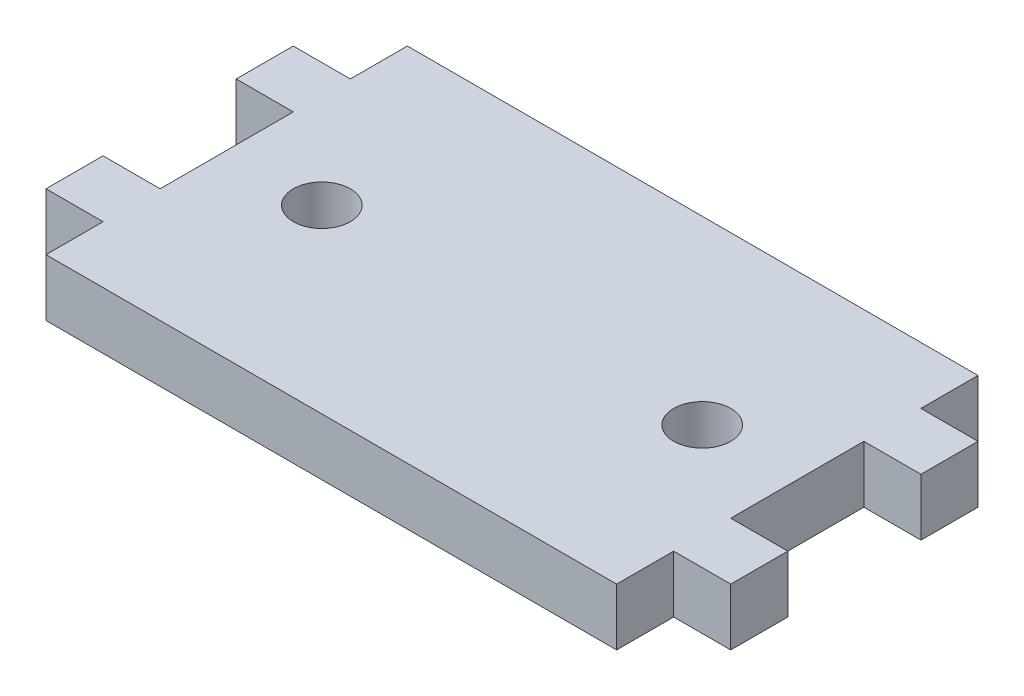
ISO-10303-21;
HEADER;
FILE_DESCRIPTION(('STEP AP214'),'2;1');
FILE_NAME('part.step','',(''),(''),'','','');
FILE_SCHEMA(('AUTOMOTIVE_DESIGN { 1 0 10303 214 1 1 1 1 }'));
ENDSEC;
DATA;
#1=APPLICATION_CONTEXT('core data for automotive mechanical design processes');
#2=APPLICATION_PROTOCOL_DEFINITION('international standard','automotive_design',2000,#1);
#3=PRODUCT_CONTEXT('',#1,'mechanical');
#4=PRODUCT('Part','Part','',(#3));
#5=PRODUCT_RELATED_PRODUCT_CATEGORY('part','',(#4));
#6=PRODUCT_DEFINITION_FORMATION('','',#4);
#7=PRODUCT_DEFINITION_CONTEXT('part definition',#1,'design');
#8=PRODUCT_DEFINITION('design','',#6,#7);
#9=PRODUCT_DEFINITION_SHAPE('','',#8);
#10=(LENGTH_UNIT() NAMED_UNIT(*) SI_UNIT(.MILLI.,.METRE.));
#11=(NAMED_UNIT(*) PLANE_ANGLE_UNIT() SI_UNIT($,.RADIAN.));
#12=(NAMED_UNIT(*) SI_UNIT($,.STERADIAN.) SOLID_ANGLE_UNIT());
#13=UNCERTAINTY_MEASURE_WITH_UNIT(LENGTH_MEASURE(1.E-05),#10,'distance_accuracy_value','');
#14=(GEOMETRIC_REPRESENTATION_CONTEXT(3) GLOBAL_UNCERTAINTY_ASSIGNED_CONTEXT((#13)) GLOBAL_UNIT_ASSIGNED_CONTEXT((#10,
#11,#12)) REPRESENTATION_CONTEXT('',''));
#15=CARTESIAN_POINT('',(0.,0.,0.));
#16=DIRECTION('',(0.,0.,1.));
#17=DIRECTION('',(1.,0.,0.));
#18=AXIS2_PLACEMENT_3D('',#15,#16,#17);
#19=CARTESIAN_POINT('',(0.,3.,0.));
#20=DIRECTION('',(0.,-1.,0.));
#21=DIRECTION('',(0.,0.,-1.));
#22=AXIS2_PLACEMENT_3D('',#19,#20,#21);
#23=PLANE('',#22);
#24=CARTESIAN_POINT('',(-34.8674121918661,3.,-3.5));
#25=DIRECTION('',(0.,1.,0.));
#26=DIRECTION('',(0.,0.,1.));
#27=AXIS2_PLACEMENT_3D('',#24,#25,#26);
#28=CIRCLE('',#27,1.5);
#29=CARTESIAN_POINT('',(-34.8674121918661,3.,-2.));
#30=VERTEX_POINT('',#29);
#31=EDGE_CURVE('E204',#30,#30,#28,.T.);
#32=ORIENTED_EDGE('',*,*,#31,.F.);
#33=EDGE_LOOP('',(#32));
#34=FACE_BOUND('',#33,.T.);
#35=DIRECTION('',(1.,0.,0.));
#36=VECTOR('',#35,1.);
#37=CARTESIAN_POINT('',(-39.8674121918661,3.,-7.));
#38=LINE('',#37,#36);
#39=CARTESIAN_POINT('',(-42.8674121918661,3.,-7.));
#40=VERTEX_POINT('',#39);
#41=CARTESIAN_POINT('',(-39.8674121918661,3.,-7.));
#42=VERTEX_POINT('',#41);
#43=EDGE_CURVE('E239',#40,#42,#38,.T.);
#44=ORIENTED_EDGE('',*,*,#43,.T.);
#45=DIRECTION('',(0.,0.,1.));
#46=VECTOR('',#45,1.);
#47=CARTESIAN_POINT('',(-39.8674121918661,3.,0.));
#48=LINE('',#47,#46);
#49=CARTESIAN_POINT('',(-39.8674121918661,3.,0.));
#50=VERTEX_POINT('',#49);
#51=EDGE_CURVE('E127',#42,#50,#48,.T.);
#52=ORIENTED_EDGE('',*,*,#51,.T.);
#53=DIRECTION('',(-1.,0.,0.));
#54=VECTOR('',#53,1.);
#55=CARTESIAN_POINT('',(-42.8674121918661,3.,0.));
#56=LINE('',#55,#54);
#57=CARTESIAN_POINT('',(-42.8674121918661,3.,0.));
#58=VERTEX_POINT('',#57);
#59=EDGE_CURVE('E290',#50,#58,#56,.T.);
#60=ORIENTED_EDGE('',*,*,#59,.T.);
#61=DIRECTION('',(0.,0.,1.));
#62=VECTOR('',#61,1.);
#63=CARTESIAN_POINT('',(-42.8674121918661,3.,3.));
#64=LINE('',#63,#62);
#65=CARTESIAN_POINT('',(-42.8674121918661,3.,3.));
#66=VERTEX_POINT('',#65);
#67=EDGE_CURVE('E309',#58,#66,#64,.T.);
#68=ORIENTED_EDGE('',*,*,#67,.T.);
#69=DIRECTION('',(1.,0.,0.));
#70=VECTOR('',#69,1.);
#71=CARTESIAN_POINT('',(-39.8674121918661,3.,3.));
#72=LINE('',#71,#70);
#73=CARTESIAN_POINT('',(-39.8674121918661,3.,3.));
#74=VERTEX_POINT('',#73);
#75=EDGE_CURVE('E306',#66,#74,#72,.T.);
#76=ORIENTED_EDGE('',*,*,#75,.T.);
#77=DIRECTION('',(0.,0.,1.));
#78=VECTOR('',#77,1.);
#79=CARTESIAN_POINT('',(-39.8674121918661,3.,5.99999999999999));
#80=LINE('',#79,#78);
#81=CARTESIAN_POINT('',(-39.8674121918661,3.,5.99999999999999));
#82=VERTEX_POINT('',#81);
#83=EDGE_CURVE('E308',#74,#82,#80,.T.);
#84=ORIENTED_EDGE('',*,*,#83,.T.);
#85=DIRECTION('',(1.,0.,0.));
#86=VECTOR('',#85,1.);
#87=CARTESIAN_POINT('',(-9.86741219186607,3.,5.99999999999999));
#88=LINE('',#87,#86);
#89=CARTESIAN_POINT('',(-9.86741219186607,3.,5.99999999999999));
#90=VERTEX_POINT('',#89);
#91=EDGE_CURVE('E311',#82,#90,#88,.T.);
#92=ORIENTED_EDGE('',*,*,#91,.T.);
#93=DIRECTION('',(0.,0.,-1.));
#94=VECTOR('',#93,1.);
#95=CARTESIAN_POINT('',(-9.86741219186607,3.,3.));
#96=LINE('',#95,#94);
#97=CARTESIAN_POINT('',(-9.86741219186607,3.,3.));
#98=VERTEX_POINT('',#97);
#99=EDGE_CURVE('E317',#90,#98,#96,.T.);
#100=ORIENTED_EDGE('',*,*,#99,.T.);
#101=DIRECTION('',(1.,0.,0.));
#102=VECTOR('',#101,1.);
#103=CARTESIAN_POINT('',(-6.86741219186606,3.,3.));
#104=LINE('',#103,#102);
#105=CARTESIAN_POINT('',(-6.86741219186606,3.,3.));
#106=VERTEX_POINT('',#105);
#107=EDGE_CURVE('E319',#98,#106,#104,.T.);
#108=ORIENTED_EDGE('',*,*,#107,.T.);
#109=DIRECTION('',(0.,0.,-1.));
#110=VECTOR('',#109,1.);
#111=CARTESIAN_POINT('',(-6.86741219186606,3.,0.));
#112=LINE('',#111,#110);
#113=CARTESIAN_POINT('',(-6.86741219186606,3.,0.));
#114=VERTEX_POINT('',#113);
#115=EDGE_CURVE('E321',#106,#114,#112,.T.);
#116=ORIENTED_EDGE('',*,*,#115,.T.);
#117=DIRECTION('',(-1.,0.,0.));
#118=VECTOR('',#117,1.);
#119=CARTESIAN_POINT('',(-9.86741219186607,3.,0.));
#120=LINE('',#119,#118);
#121=CARTESIAN_POINT('',(-9.86741219186607,3.,0.));
#122=VERTEX_POINT('',#121);
#123=EDGE_CURVE('E323',#114,#122,#120,.T.);
#124=ORIENTED_EDGE('',*,*,#123,.T.);
#125=DIRECTION('',(0.,0.,-1.));
#126=VECTOR('',#125,1.);
#127=CARTESIAN_POINT('',(-9.86741219186607,3.,-7.));
#128=LINE('',#127,#126);
#129=CARTESIAN_POINT('',(-9.86741219186607,3.,-7.));
#130=VERTEX_POINT('',#129);
#131=EDGE_CURVE('E325',#122,#130,#128,.T.);
#132=ORIENTED_EDGE('',*,*,#131,.T.);
#133=DIRECTION('',(1.,0.,0.));
#134=VECTOR('',#133,1.);
#135=CARTESIAN_POINT('',(-6.86741219186607,3.,-7.));
#136=LINE('',#135,#134);
#137=CARTESIAN_POINT('',(-6.86741219186607,3.,-7.));
#138=VERTEX_POINT('',#137);
#139=EDGE_CURVE('E327',#130,#138,#136,.T.);
#140=ORIENTED_EDGE('',*,*,#139,.T.);
#141=DIRECTION('',(0.,0.,-1.));
#142=VECTOR('',#141,1.);
#143=CARTESIAN_POINT('',(-6.86741219186607,3.,-9.99999999999999));
#144=LINE('',#143,#142);
#145=CARTESIAN_POINT('',(-6.86741219186607,3.,-9.99999999999999));
#146=VERTEX_POINT('',#145);
#147=EDGE_CURVE('E329',#138,#146,#144,.T.);
#148=ORIENTED_EDGE('',*,*,#147,.T.);
#149=DIRECTION('',(-1.,0.,0.));
#150=VECTOR('',#149,1.);
#151=CARTESIAN_POINT('',(-9.86741219186607,3.,-9.99999999999999));
#152=LINE('',#151,#150);
#153=CARTESIAN_POINT('',(-9.86741219186607,3.,-9.99999999999999));
#154=VERTEX_POINT('',#153);
#155=EDGE_CURVE('E331',#146,#154,#152,.T.);
#156=ORIENTED_EDGE('',*,*,#155,.T.);
#157=DIRECTION('',(0.,0.,-1.));
#158=VECTOR('',#157,1.);
#159=CARTESIAN_POINT('',(-9.86741219186607,3.,-13.));
#160=LINE('',#159,#158);
#161=CARTESIAN_POINT('',(-9.86741219186607,3.,-13.));
#162=VERTEX_POINT('',#161);
#163=EDGE_CURVE('E333',#154,#162,#160,.T.);
#164=ORIENTED_EDGE('',*,*,#163,.T.);
#165=DIRECTION('',(-1.,0.,0.));
#166=VECTOR('',#165,1.);
#167=CARTESIAN_POINT('',(-39.8674121918661,3.,-13.));
#168=LINE('',#167,#166);
#169=CARTESIAN_POINT('',(-39.8674121918661,3.,-13.));
#170=VERTEX_POINT('',#169);
#171=EDGE_CURVE('E182',#162,#170,#168,.T.);
#172=ORIENTED_EDGE('',*,*,#171,.T.);
#173=DIRECTION('',(0.,0.,1.));
#174=VECTOR('',#173,1.);
#175=CARTESIAN_POINT('',(-39.8674121918661,3.,-9.99999999999999));
#176=LINE('',#175,#174);
#177=CARTESIAN_POINT('',(-39.8674121918661,3.,-9.99999999999999));
#178=VERTEX_POINT('',#177);
#179=EDGE_CURVE('E176',#170,#178,#176,.T.);
#180=ORIENTED_EDGE('',*,*,#179,.T.);
#181=DIRECTION('',(-1.,0.,0.));
#182=VECTOR('',#181,1.);
#183=CARTESIAN_POINT('',(-42.8674121918661,3.,-9.99999999999999));
#184=LINE('',#183,#182);
#185=CARTESIAN_POINT('',(-42.8674121918661,3.,-9.99999999999999));
#186=VERTEX_POINT('',#185);
#187=EDGE_CURVE('E180',#178,#186,#184,.T.);
#188=ORIENTED_EDGE('',*,*,#187,.T.);
#189=DIRECTION('',(0.,0.,1.));
#190=VECTOR('',#189,1.);
#191=CARTESIAN_POINT('',(-42.8674121918661,3.,-7.));
#192=LINE('',#191,#190);
#193=EDGE_CURVE('E48',#186,#40,#192,.T.);
#194=ORIENTED_EDGE('',*,*,#193,.T.);
#195=EDGE_LOOP('',(#44,#52,#60,#68,#76,#84,#92,#100,#108,#116,#124,#132,#140,#148,#156,#164,
#172,#180,#188,#194));
#196=FACE_BOUND('',#195,.T.);
#197=CARTESIAN_POINT('',(-14.8674121918661,3.,-3.50000000000001));
#198=DIRECTION('',(0.,1.,0.));
#199=DIRECTION('',(0.,0.,-1.));
#200=AXIS2_PLACEMENT_3D('',#197,#198,#199);
#201=CIRCLE('',#200,1.5);
#202=CARTESIAN_POINT('',(-14.8674121918661,3.,-5.00000000000001));
#203=VERTEX_POINT('',#202);
#204=EDGE_CURVE('E376',#203,#203,#201,.T.);
#205=ORIENTED_EDGE('',*,*,#204,.F.);
#206=EDGE_LOOP('',(#205));
#207=FACE_BOUND('',#206,.T.);
#208=ADVANCED_FACE('F31',(#34,#196,#207),#23,.F.);
#209=CARTESIAN_POINT('',(0.,0.,0.));
#210=DIRECTION('',(0.,-1.,0.));
#211=DIRECTION('',(0.,0.,-1.));
#212=AXIS2_PLACEMENT_3D('',#209,#210,#211);
#213=PLANE('',#212);
#214=CARTESIAN_POINT('',(-34.8674121918661,0.,-3.5));
#215=DIRECTION('',(0.,1.,0.));
#216=DIRECTION('',(0.,0.,1.));
#217=AXIS2_PLACEMENT_3D('',#214,#215,#216);
#218=CIRCLE('',#217,1.5);
#219=CARTESIAN_POINT('',(-34.8674121918661,0.,-2.));
#220=VERTEX_POINT('',#219);
#221=EDGE_CURVE('E381',#220,#220,#218,.T.);
#222=ORIENTED_EDGE('',*,*,#221,.T.);
#223=EDGE_LOOP('',(#222));
#224=FACE_BOUND('',#223,.T.);
#225=DIRECTION('',(1.,0.,0.));
#226=VECTOR('',#225,1.);
#227=CARTESIAN_POINT('',(-39.8674121918661,0.,-7.));
#228=LINE('',#227,#226);
#229=CARTESIAN_POINT('',(-42.8674121918661,0.,-7.));
#230=VERTEX_POINT('',#229);
#231=CARTESIAN_POINT('',(-39.8674121918661,0.,-7.));
#232=VERTEX_POINT('',#231);
#233=EDGE_CURVE('E200',#230,#232,#228,.T.);
#234=ORIENTED_EDGE('',*,*,#233,.F.);
#235=DIRECTION('',(0.,0.,1.));
#236=VECTOR('',#235,1.);
#237=CARTESIAN_POINT('',(-42.8674121918661,0.,-7.));
#238=LINE('',#237,#236);
#239=CARTESIAN_POINT('',(-42.8674121918661,0.,-9.99999999999999));
#240=VERTEX_POINT('',#239);
#241=EDGE_CURVE('E119',#240,#230,#238,.T.);
#242=ORIENTED_EDGE('',*,*,#241,.F.);
#243=DIRECTION('',(-1.,0.,0.));
#244=VECTOR('',#243,1.);
#245=CARTESIAN_POINT('',(-42.8674121918661,0.,-9.99999999999999));
#246=LINE('',#245,#244);
#247=CARTESIAN_POINT('',(-39.8674121918661,0.,-9.99999999999999));
#248=VERTEX_POINT('',#247);
#249=EDGE_CURVE('E113',#248,#240,#246,.T.);
#250=ORIENTED_EDGE('',*,*,#249,.F.);
#251=DIRECTION('',(0.,0.,1.));
#252=VECTOR('',#251,1.);
#253=CARTESIAN_POINT('',(-39.8674121918661,0.,-9.99999999999999));
#254=LINE('',#253,#252);
#255=CARTESIAN_POINT('',(-39.8674121918661,0.,-13.));
#256=VERTEX_POINT('',#255);
#257=EDGE_CURVE('E190',#256,#248,#254,.T.);
#258=ORIENTED_EDGE('',*,*,#257,.F.);
#259=DIRECTION('',(-1.,0.,0.));
#260=VECTOR('',#259,1.);
#261=CARTESIAN_POINT('',(-39.8674121918661,0.,-13.));
#262=LINE('',#261,#260);
#263=CARTESIAN_POINT('',(-9.86741219186607,0.,-13.));
#264=VERTEX_POINT('',#263);
#265=EDGE_CURVE('E234',#264,#256,#262,.T.);
#266=ORIENTED_EDGE('',*,*,#265,.F.);
#267=DIRECTION('',(0.,0.,-1.));
#268=VECTOR('',#267,1.);
#269=CARTESIAN_POINT('',(-9.86741219186607,0.,-13.));
#270=LINE('',#269,#268);
#271=CARTESIAN_POINT('',(-9.86741219186607,0.,-9.99999999999999));
#272=VERTEX_POINT('',#271);
#273=EDGE_CURVE('E232',#272,#264,#270,.T.);
#274=ORIENTED_EDGE('',*,*,#273,.F.);
#275=DIRECTION('',(-1.,0.,0.));
#276=VECTOR('',#275,1.);
#277=CARTESIAN_POINT('',(-9.86741219186607,0.,-9.99999999999999));
#278=LINE('',#277,#276);
#279=CARTESIAN_POINT('',(-6.86741219186607,0.,-9.99999999999999));
#280=VERTEX_POINT('',#279);
#281=EDGE_CURVE('E230',#280,#272,#278,.T.);
#282=ORIENTED_EDGE('',*,*,#281,.F.);
#283=DIRECTION('',(0.,0.,-1.));
#284=VECTOR('',#283,1.);
#285=CARTESIAN_POINT('',(-6.86741219186607,0.,-9.99999999999999));
#286=LINE('',#285,#284);
#287=CARTESIAN_POINT('',(-6.86741219186607,0.,-7.));
#288=VERTEX_POINT('',#287);
#289=EDGE_CURVE('E228',#288,#280,#286,.T.);
#290=ORIENTED_EDGE('',*,*,#289,.F.);
#291=DIRECTION('',(1.,0.,0.));
#292=VECTOR('',#291,1.);
#293=CARTESIAN_POINT('',(-6.86741219186607,0.,-7.));
#294=LINE('',#293,#292);
#295=CARTESIAN_POINT('',(-9.86741219186607,0.,-7.));
#296=VERTEX_POINT('',#295);
#297=EDGE_CURVE('E226',#296,#288,#294,.T.);
#298=ORIENTED_EDGE('',*,*,#297,.F.);
#299=DIRECTION('',(0.,0.,-1.));
#300=VECTOR('',#299,1.);
#301=CARTESIAN_POINT('',(-9.86741219186607,0.,-7.));
#302=LINE('',#301,#300);
#303=CARTESIAN_POINT('',(-9.86741219186607,0.,0.));
#304=VERTEX_POINT('',#303);
#305=EDGE_CURVE('E224',#304,#296,#302,.T.);
#306=ORIENTED_EDGE('',*,*,#305,.F.);
#307=DIRECTION('',(-1.,0.,0.));
#308=VECTOR('',#307,1.);
#309=CARTESIAN_POINT('',(-9.86741219186607,0.,0.));
#310=LINE('',#309,#308);
#311=CARTESIAN_POINT('',(-6.86741219186606,0.,0.));
#312=VERTEX_POINT('',#311);
#313=EDGE_CURVE('E222',#312,#304,#310,.T.);
#314=ORIENTED_EDGE('',*,*,#313,.F.);
#315=DIRECTION('',(0.,0.,-1.));
#316=VECTOR('',#315,1.);
#317=CARTESIAN_POINT('',(-6.86741219186606,0.,0.));
#318=LINE('',#317,#316);
#319=CARTESIAN_POINT('',(-6.86741219186606,0.,3.));
#320=VERTEX_POINT('',#319);
#321=EDGE_CURVE('E220',#320,#312,#318,.T.);
#322=ORIENTED_EDGE('',*,*,#321,.F.);
#323=DIRECTION('',(1.,0.,0.));
#324=VECTOR('',#323,1.);
#325=CARTESIAN_POINT('',(-6.86741219186606,0.,3.));
#326=LINE('',#325,#324);
#327=CARTESIAN_POINT('',(-9.86741219186607,0.,3.));
#328=VERTEX_POINT('',#327);
#329=EDGE_CURVE('E218',#328,#320,#326,.T.);
#330=ORIENTED_EDGE('',*,*,#329,.F.);
#331=DIRECTION('',(0.,0.,-1.));
#332=VECTOR('',#331,1.);
#333=CARTESIAN_POINT('',(-9.86741219186607,0.,3.));
#334=LINE('',#333,#332);
#335=CARTESIAN_POINT('',(-9.86741219186607,0.,5.99999999999999));
#336=VERTEX_POINT('',#335);
#337=EDGE_CURVE('E216',#336,#328,#334,.T.);
#338=ORIENTED_EDGE('',*,*,#337,.F.);
#339=DIRECTION('',(1.,0.,0.));
#340=VECTOR('',#339,1.);
#341=CARTESIAN_POINT('',(-9.86741219186607,0.,5.99999999999999));
#342=LINE('',#341,#340);
#343=CARTESIAN_POINT('',(-39.8674121918661,0.,5.99999999999999));
#344=VERTEX_POINT('',#343);
#345=EDGE_CURVE('E214',#344,#336,#342,.T.);
#346=ORIENTED_EDGE('',*,*,#345,.F.);
#347=DIRECTION('',(0.,0.,1.));
#348=VECTOR('',#347,1.);
#349=CARTESIAN_POINT('',(-39.8674121918661,0.,5.99999999999999));
#350=LINE('',#349,#348);
#351=CARTESIAN_POINT('',(-39.8674121918661,0.,3.));
#352=VERTEX_POINT('',#351);
#353=EDGE_CURVE('E212',#352,#344,#350,.T.);
#354=ORIENTED_EDGE('',*,*,#353,.F.);
#355=DIRECTION('',(1.,0.,0.));
#356=VECTOR('',#355,1.);
#357=CARTESIAN_POINT('',(-39.8674121918661,0.,3.));
#358=LINE('',#357,#356);
#359=CARTESIAN_POINT('',(-42.8674121918661,0.,3.));
#360=VERTEX_POINT('',#359);
#361=EDGE_CURVE('E210',#360,#352,#358,.T.);
#362=ORIENTED_EDGE('',*,*,#361,.F.);
#363=DIRECTION('',(0.,0.,1.));
#364=VECTOR('',#363,1.);
#365=CARTESIAN_POINT('',(-42.8674121918661,0.,3.));
#366=LINE('',#365,#364);
#367=CARTESIAN_POINT('',(-42.8674121918661,0.,0.));
#368=VERTEX_POINT('',#367);
#369=EDGE_CURVE('E208',#368,#360,#366,.T.);
#370=ORIENTED_EDGE('',*,*,#369,.F.);
#371=DIRECTION('',(-1.,0.,0.));
#372=VECTOR('',#371,1.);
#373=CARTESIAN_POINT('',(-42.8674121918661,0.,0.));
#374=LINE('',#373,#372);
#375=CARTESIAN_POINT('',(-39.8674121918661,0.,0.));
#376=VERTEX_POINT('',#375);
#377=EDGE_CURVE('E206',#376,#368,#374,.T.);
#378=ORIENTED_EDGE('',*,*,#377,.F.);
#379=DIRECTION('',(0.,0.,1.));
#380=VECTOR('',#379,1.);
#381=CARTESIAN_POINT('',(-39.8674121918661,0.,0.));
#382=LINE('',#381,#380);
#383=EDGE_CURVE('E203',#232,#376,#382,.T.);
#384=ORIENTED_EDGE('',*,*,#383,.F.);
#385=EDGE_LOOP('',(#234,#242,#250,#258,#266,#274,#282,#290,#298,#306,#314,#322,#330,#338,#346,
#354,#362,#370,#378,#384));
#386=FACE_BOUND('',#385,.T.);
#387=CARTESIAN_POINT('',(-14.8674121918661,0.,-3.50000000000001));
#388=DIRECTION('',(0.,1.,0.));
#389=DIRECTION('',(0.,0.,-1.));
#390=AXIS2_PLACEMENT_3D('',#387,#388,#389);
#391=CIRCLE('',#390,1.5);
#392=CARTESIAN_POINT('',(-14.8674121918661,0.,-5.00000000000001));
#393=VERTEX_POINT('',#392);
#394=EDGE_CURVE('E379',#393,#393,#391,.T.);
#395=ORIENTED_EDGE('',*,*,#394,.T.);
#396=EDGE_LOOP('',(#395));
#397=FACE_BOUND('',#396,.T.);
#398=ADVANCED_FACE('F294',(#224,#386,#397),#213,.T.);
#399=CARTESIAN_POINT('',(-39.8674121918661,3.,-7.));
#400=DIRECTION('',(0.,0.,-1.));
#401=DIRECTION('',(-1.,0.,0.));
#402=AXIS2_PLACEMENT_3D('',#399,#400,#401);
#403=PLANE('',#402);
#404=ORIENTED_EDGE('',*,*,#233,.T.);
#405=DIRECTION('',(0.,-1.,0.));
#406=VECTOR('',#405,1.);
#407=CARTESIAN_POINT('',(-39.8674121918661,3.,-7.));
#408=LINE('',#407,#406);
#409=EDGE_CURVE('E11',#42,#232,#408,.T.);
#410=ORIENTED_EDGE('',*,*,#409,.F.);
#411=ORIENTED_EDGE('',*,*,#43,.F.);
#412=DIRECTION('',(0.,-1.,0.));
#413=VECTOR('',#412,1.);
#414=CARTESIAN_POINT('',(-42.8674121918661,3.,-7.));
#415=LINE('',#414,#413);
#416=EDGE_CURVE('E196',#40,#230,#415,.T.);
#417=ORIENTED_EDGE('',*,*,#416,.T.);
#418=EDGE_LOOP('',(#404,#410,#411,#417));
#419=FACE_BOUND('',#418,.T.);
#420=ADVANCED_FACE('F33',(#419),#403,.F.);
#421=CARTESIAN_POINT('',(-39.8674121918661,3.,0.));
#422=DIRECTION('',(1.,0.,0.));
#423=DIRECTION('',(0.,0.,-1.));
#424=AXIS2_PLACEMENT_3D('',#421,#422,#423);
#425=PLANE('',#424);
#426=ORIENTED_EDGE('',*,*,#383,.T.);
#427=DIRECTION('',(0.,-1.,0.));
#428=VECTOR('',#427,1.);
#429=CARTESIAN_POINT('',(-39.8674121918661,3.,0.));
#430=LINE('',#429,#428);
#431=EDGE_CURVE('E40',#50,#376,#430,.T.);
#432=ORIENTED_EDGE('',*,*,#431,.F.);
#433=ORIENTED_EDGE('',*,*,#51,.F.);
#434=ORIENTED_EDGE('',*,*,#409,.T.);
#435=EDGE_LOOP('',(#426,#432,#433,#434));
#436=FACE_BOUND('',#435,.T.);
#437=ADVANCED_FACE('F554',(#436),#425,.F.);
#438=CARTESIAN_POINT('',(-42.8674121918661,3.,0.));
#439=DIRECTION('',(0.,0.,1.));
#440=DIRECTION('',(1.,0.,0.));
#441=AXIS2_PLACEMENT_3D('',#438,#439,#440);
#442=PLANE('',#441);
#443=ORIENTED_EDGE('',*,*,#377,.T.);
#444=DIRECTION('',(0.,-1.,0.));
#445=VECTOR('',#444,1.);
#446=CARTESIAN_POINT('',(-42.8674121918661,3.,0.));
#447=LINE('',#446,#445);
#448=EDGE_CURVE('E282',#58,#368,#447,.T.);
#449=ORIENTED_EDGE('',*,*,#448,.F.);
#450=ORIENTED_EDGE('',*,*,#59,.F.);
#451=ORIENTED_EDGE('',*,*,#431,.T.);
#452=EDGE_LOOP('',(#443,#449,#450,#451));
#453=FACE_BOUND('',#452,.T.);
#454=ADVANCED_FACE('F288',(#453),#442,.F.);
#455=CARTESIAN_POINT('',(-42.8674121918661,3.,3.));
#456=DIRECTION('',(1.,0.,0.));
#457=DIRECTION('',(0.,0.,-1.));
#458=AXIS2_PLACEMENT_3D('',#455,#456,#457);
#459=PLANE('',#458);
#460=ORIENTED_EDGE('',*,*,#369,.T.);
#461=DIRECTION('',(0.,-1.,0.));
#462=VECTOR('',#461,1.);
#463=CARTESIAN_POINT('',(-42.8674121918661,3.,3.));
#464=LINE('',#463,#462);
#465=EDGE_CURVE('E279',#66,#360,#464,.T.);
#466=ORIENTED_EDGE('',*,*,#465,.F.);
#467=ORIENTED_EDGE('',*,*,#67,.F.);
#468=ORIENTED_EDGE('',*,*,#448,.T.);
#469=EDGE_LOOP('',(#460,#466,#467,#468));
#470=FACE_BOUND('',#469,.T.);
#471=ADVANCED_FACE('F300',(#470),#459,.F.);
#472=CARTESIAN_POINT('',(-39.8674121918661,3.,3.));
#473=DIRECTION('',(0.,0.,-1.));
#474=DIRECTION('',(-1.,0.,0.));
#475=AXIS2_PLACEMENT_3D('',#472,#473,#474);
#476=PLANE('',#475);
#477=ORIENTED_EDGE('',*,*,#361,.T.);
#478=DIRECTION('',(0.,-1.,0.));
#479=VECTOR('',#478,1.);
#480=CARTESIAN_POINT('',(-39.8674121918661,3.,3.));
#481=LINE('',#480,#479);
#482=EDGE_CURVE('E276',#74,#352,#481,.T.);
#483=ORIENTED_EDGE('',*,*,#482,.F.);
#484=ORIENTED_EDGE('',*,*,#75,.F.);
#485=ORIENTED_EDGE('',*,*,#465,.T.);
#486=EDGE_LOOP('',(#477,#483,#484,#485));
#487=FACE_BOUND('',#486,.T.);
#488=ADVANCED_FACE('F304',(#487),#476,.F.);
#489=CARTESIAN_POINT('',(-39.8674121918661,3.,5.99999999999999));
#490=DIRECTION('',(1.,0.,0.));
#491=DIRECTION('',(0.,0.,-1.));
#492=AXIS2_PLACEMENT_3D('',#489,#490,#491);
#493=PLANE('',#492);
#494=ORIENTED_EDGE('',*,*,#353,.T.);
#495=DIRECTION('',(0.,-1.,0.));
#496=VECTOR('',#495,1.);
#497=CARTESIAN_POINT('',(-39.8674121918661,3.,5.99999999999999));
#498=LINE('',#497,#496);
#499=EDGE_CURVE('E273',#82,#344,#498,.T.);
#500=ORIENTED_EDGE('',*,*,#499,.F.);
#501=ORIENTED_EDGE('',*,*,#83,.F.);
#502=ORIENTED_EDGE('',*,*,#482,.T.);
#503=EDGE_LOOP('',(#494,#500,#501,#502));
#504=FACE_BOUND('',#503,.T.);
#505=ADVANCED_FACE('F519',(#504),#493,.F.);
#506=CARTESIAN_POINT('',(-9.86741219186607,3.,5.99999999999999));
#507=DIRECTION('',(0.,0.,-1.));
#508=DIRECTION('',(-1.,0.,0.));
#509=AXIS2_PLACEMENT_3D('',#506,#507,#508);
#510=PLANE('',#509);
#511=ORIENTED_EDGE('',*,*,#345,.T.);
#512=DIRECTION('',(0.,-1.,0.));
#513=VECTOR('',#512,1.);
#514=CARTESIAN_POINT('',(-9.86741219186607,3.,5.99999999999999));
#515=LINE('',#514,#513);
#516=EDGE_CURVE('E270',#90,#336,#515,.T.);
#517=ORIENTED_EDGE('',*,*,#516,.F.);
#518=ORIENTED_EDGE('',*,*,#91,.F.);
#519=ORIENTED_EDGE('',*,*,#499,.T.);
#520=EDGE_LOOP('',(#511,#517,#518,#519));
#521=FACE_BOUND('',#520,.T.);
#522=ADVANCED_FACE('F509',(#521),#510,.F.);
#523=CARTESIAN_POINT('',(-9.86741219186607,3.,3.));
#524=DIRECTION('',(-1.,0.,0.));
#525=DIRECTION('',(0.,0.,1.));
#526=AXIS2_PLACEMENT_3D('',#523,#524,#525);
#527=PLANE('',#526);
#528=ORIENTED_EDGE('',*,*,#337,.T.);
#529=DIRECTION('',(0.,-1.,0.));
#530=VECTOR('',#529,1.);
#531=CARTESIAN_POINT('',(-9.86741219186607,3.,3.));
#532=LINE('',#531,#530);
#533=EDGE_CURVE('E267',#98,#328,#532,.T.);
#534=ORIENTED_EDGE('',*,*,#533,.F.);
#535=ORIENTED_EDGE('',*,*,#99,.F.);
#536=ORIENTED_EDGE('',*,*,#516,.T.);
#537=EDGE_LOOP('',(#528,#534,#535,#536));
#538=FACE_BOUND('',#537,.T.);
#539=ADVANCED_FACE('F499',(#538),#527,.F.);
#540=CARTESIAN_POINT('',(-6.86741219186606,3.,3.));
#541=DIRECTION('',(0.,0.,-1.));
#542=DIRECTION('',(-1.,0.,0.));
#543=AXIS2_PLACEMENT_3D('',#540,#541,#542);
#544=PLANE('',#543);
#545=ORIENTED_EDGE('',*,*,#329,.T.);
#546=DIRECTION('',(0.,-1.,0.));
#547=VECTOR('',#546,1.);
#548=CARTESIAN_POINT('',(-6.86741219186606,3.,3.));
#549=LINE('',#548,#547);
#550=EDGE_CURVE('E264',#106,#320,#549,.T.);
#551=ORIENTED_EDGE('',*,*,#550,.F.);
#552=ORIENTED_EDGE('',*,*,#107,.F.);
#553=ORIENTED_EDGE('',*,*,#533,.T.);
#554=EDGE_LOOP('',(#545,#551,#552,#553));
#555=FACE_BOUND('',#554,.T.);
#556=ADVANCED_FACE('F489',(#555),#544,.F.);
#557=CARTESIAN_POINT('',(-6.86741219186606,3.,0.));
#558=DIRECTION('',(-1.,0.,0.));
#559=DIRECTION('',(0.,0.,1.));
#560=AXIS2_PLACEMENT_3D('',#557,#558,#559);
#561=PLANE('',#560);
#562=ORIENTED_EDGE('',*,*,#321,.T.);
#563=DIRECTION('',(0.,-1.,0.));
#564=VECTOR('',#563,1.);
#565=CARTESIAN_POINT('',(-6.86741219186606,3.,0.));
#566=LINE('',#565,#564);
#567=EDGE_CURVE('E261',#114,#312,#566,.T.);
#568=ORIENTED_EDGE('',*,*,#567,.F.);
#569=ORIENTED_EDGE('',*,*,#115,.F.);
#570=ORIENTED_EDGE('',*,*,#550,.T.);
#571=EDGE_LOOP('',(#562,#568,#569,#570));
#572=FACE_BOUND('',#571,.T.);
#573=ADVANCED_FACE('F479',(#572),#561,.F.);
#574=CARTESIAN_POINT('',(-9.86741219186607,3.,0.));
#575=DIRECTION('',(0.,0.,1.));
#576=DIRECTION('',(1.,0.,0.));
#577=AXIS2_PLACEMENT_3D('',#574,#575,#576);
#578=PLANE('',#577);
#579=ORIENTED_EDGE('',*,*,#313,.T.);
#580=DIRECTION('',(0.,-1.,0.));
#581=VECTOR('',#580,1.);
#582=CARTESIAN_POINT('',(-9.86741219186607,3.,0.));
#583=LINE('',#582,#581);
#584=EDGE_CURVE('E258',#122,#304,#583,.T.);
#585=ORIENTED_EDGE('',*,*,#584,.F.);
#586=ORIENTED_EDGE('',*,*,#123,.F.);
#587=ORIENTED_EDGE('',*,*,#567,.T.);
#588=EDGE_LOOP('',(#579,#585,#586,#587));
#589=FACE_BOUND('',#588,.T.);
#590=ADVANCED_FACE('F469',(#589),#578,.F.);
#591=CARTESIAN_POINT('',(-9.86741219186607,3.,-7.));
#592=DIRECTION('',(-1.,0.,0.));
#593=DIRECTION('',(0.,0.,1.));
#594=AXIS2_PLACEMENT_3D('',#591,#592,#593);
#595=PLANE('',#594);
#596=ORIENTED_EDGE('',*,*,#305,.T.);
#597=DIRECTION('',(0.,-1.,0.));
#598=VECTOR('',#597,1.);
#599=CARTESIAN_POINT('',(-9.86741219186607,3.,-7.));
#600=LINE('',#599,#598);
#601=EDGE_CURVE('E255',#130,#296,#600,.T.);
#602=ORIENTED_EDGE('',*,*,#601,.F.);
#603=ORIENTED_EDGE('',*,*,#131,.F.);
#604=ORIENTED_EDGE('',*,*,#584,.T.);
#605=EDGE_LOOP('',(#596,#602,#603,#604));
#606=FACE_BOUND('',#605,.T.);
#607=ADVANCED_FACE('F459',(#606),#595,.F.);
#608=CARTESIAN_POINT('',(-6.86741219186607,3.,-7.));
#609=DIRECTION('',(0.,0.,-1.));
#610=DIRECTION('',(-1.,0.,0.));
#611=AXIS2_PLACEMENT_3D('',#608,#609,#610);
#612=PLANE('',#611);
#613=ORIENTED_EDGE('',*,*,#297,.T.);
#614=DIRECTION('',(0.,-1.,0.));
#615=VECTOR('',#614,1.);
#616=CARTESIAN_POINT('',(-6.86741219186607,3.,-7.));
#617=LINE('',#616,#615);
#618=EDGE_CURVE('E252',#138,#288,#617,.T.);
#619=ORIENTED_EDGE('',*,*,#618,.F.);
#620=ORIENTED_EDGE('',*,*,#139,.F.);
#621=ORIENTED_EDGE('',*,*,#601,.T.);
#622=EDGE_LOOP('',(#613,#619,#620,#621));
#623=FACE_BOUND('',#622,.T.);
#624=ADVANCED_FACE('F449',(#623),#612,.F.);
#625=CARTESIAN_POINT('',(-6.86741219186607,3.,-9.99999999999999));
#626=DIRECTION('',(-1.,0.,0.));
#627=DIRECTION('',(0.,0.,1.));
#628=AXIS2_PLACEMENT_3D('',#625,#626,#627);
#629=PLANE('',#628);
#630=ORIENTED_EDGE('',*,*,#289,.T.);
#631=DIRECTION('',(0.,-1.,0.));
#632=VECTOR('',#631,1.);
#633=CARTESIAN_POINT('',(-6.86741219186607,3.,-9.99999999999999));
#634=LINE('',#633,#632);
#635=EDGE_CURVE('E249',#146,#280,#634,.T.);
#636=ORIENTED_EDGE('',*,*,#635,.F.);
#637=ORIENTED_EDGE('',*,*,#147,.F.);
#638=ORIENTED_EDGE('',*,*,#618,.T.);
#639=EDGE_LOOP('',(#630,#636,#637,#638));
#640=FACE_BOUND('',#639,.T.);
#641=ADVANCED_FACE('F439',(#640),#629,.F.);
#642=CARTESIAN_POINT('',(-9.86741219186607,3.,-9.99999999999999));
#643=DIRECTION('',(0.,0.,1.));
#644=DIRECTION('',(1.,0.,0.));
#645=AXIS2_PLACEMENT_3D('',#642,#643,#644);
#646=PLANE('',#645);
#647=ORIENTED_EDGE('',*,*,#281,.T.);
#648=DIRECTION('',(0.,-1.,0.));
#649=VECTOR('',#648,1.);
#650=CARTESIAN_POINT('',(-9.86741219186607,3.,-9.99999999999999));
#651=LINE('',#650,#649);
#652=EDGE_CURVE('E246',#154,#272,#651,.T.);
#653=ORIENTED_EDGE('',*,*,#652,.F.);
#654=ORIENTED_EDGE('',*,*,#155,.F.);
#655=ORIENTED_EDGE('',*,*,#635,.T.);
#656=EDGE_LOOP('',(#647,#653,#654,#655));
#657=FACE_BOUND('',#656,.T.);
#658=ADVANCED_FACE('F430',(#657),#646,.F.);
#659=CARTESIAN_POINT('',(-9.86741219186607,3.,-13.));
#660=DIRECTION('',(-1.,0.,0.));
#661=DIRECTION('',(0.,0.,1.));
#662=AXIS2_PLACEMENT_3D('',#659,#660,#661);
#663=PLANE('',#662);
#664=ORIENTED_EDGE('',*,*,#273,.T.);
#665=DIRECTION('',(0.,-1.,0.));
#666=VECTOR('',#665,1.);
#667=CARTESIAN_POINT('',(-9.86741219186607,3.,-13.));
#668=LINE('',#667,#666);
#669=EDGE_CURVE('E243',#162,#264,#668,.T.);
#670=ORIENTED_EDGE('',*,*,#669,.F.);
#671=ORIENTED_EDGE('',*,*,#163,.F.);
#672=ORIENTED_EDGE('',*,*,#652,.T.);
#673=EDGE_LOOP('',(#664,#670,#671,#672));
#674=FACE_BOUND('',#673,.T.);
#675=ADVANCED_FACE('F339',(#674),#663,.F.);
#676=CARTESIAN_POINT('',(-39.8674121918661,3.,-13.));
#677=DIRECTION('',(0.,0.,1.));
#678=DIRECTION('',(1.,0.,0.));
#679=AXIS2_PLACEMENT_3D('',#676,#677,#678);
#680=PLANE('',#679);
#681=ORIENTED_EDGE('',*,*,#265,.T.);
#682=DIRECTION('',(0.,-1.,0.));
#683=VECTOR('',#682,1.);
#684=CARTESIAN_POINT('',(-39.8674121918661,3.,-13.));
#685=LINE('',#684,#683);
#686=EDGE_CURVE('E191',#170,#256,#685,.T.);
#687=ORIENTED_EDGE('',*,*,#686,.F.);
#688=ORIENTED_EDGE('',*,*,#171,.F.);
#689=ORIENTED_EDGE('',*,*,#669,.T.);
#690=EDGE_LOOP('',(#681,#687,#688,#689));
#691=FACE_BOUND('',#690,.T.);
#692=ADVANCED_FACE('F343',(#691),#680,.F.);
#693=CARTESIAN_POINT('',(-39.8674121918661,3.,-9.99999999999999));
#694=DIRECTION('',(1.,0.,0.));
#695=DIRECTION('',(0.,0.,-1.));
#696=AXIS2_PLACEMENT_3D('',#693,#694,#695);
#697=PLANE('',#696);
#698=ORIENTED_EDGE('',*,*,#257,.T.);
#699=DIRECTION('',(0.,-1.,0.));
#700=VECTOR('',#699,1.);
#701=CARTESIAN_POINT('',(-39.8674121918661,3.,-9.99999999999999));
#702=LINE('',#701,#700);
#703=EDGE_CURVE('E187',#178,#248,#702,.T.);
#704=ORIENTED_EDGE('',*,*,#703,.F.);
#705=ORIENTED_EDGE('',*,*,#179,.F.);
#706=ORIENTED_EDGE('',*,*,#686,.T.);
#707=EDGE_LOOP('',(#698,#704,#705,#706));
#708=FACE_BOUND('',#707,.T.);
#709=ADVANCED_FACE('F188',(#708),#697,.F.);
#710=CARTESIAN_POINT('',(-42.8674121918661,3.,-9.99999999999999));
#711=DIRECTION('',(0.,0.,1.));
#712=DIRECTION('',(1.,0.,0.));
#713=AXIS2_PLACEMENT_3D('',#710,#711,#712);
#714=PLANE('',#713);
#715=ORIENTED_EDGE('',*,*,#249,.T.);
#716=DIRECTION('',(0.,-1.,0.));
#717=VECTOR('',#716,1.);
#718=CARTESIAN_POINT('',(-42.8674121918661,3.,-9.99999999999999));
#719=LINE('',#718,#717);
#720=EDGE_CURVE('E192',#186,#240,#719,.T.);
#721=ORIENTED_EDGE('',*,*,#720,.F.);
#722=ORIENTED_EDGE('',*,*,#187,.F.);
#723=ORIENTED_EDGE('',*,*,#703,.T.);
#724=EDGE_LOOP('',(#715,#721,#722,#723));
#725=FACE_BOUND('',#724,.T.);
#726=ADVANCED_FACE('F194',(#725),#714,.F.);
#727=CARTESIAN_POINT('',(-42.8674121918661,3.,-7.));
#728=DIRECTION('',(1.,0.,0.));
#729=DIRECTION('',(0.,0.,-1.));
#730=AXIS2_PLACEMENT_3D('',#727,#728,#729);
#731=PLANE('',#730);
#732=ORIENTED_EDGE('',*,*,#241,.T.);
#733=ORIENTED_EDGE('',*,*,#416,.F.);
#734=ORIENTED_EDGE('',*,*,#193,.F.);
#735=ORIENTED_EDGE('',*,*,#720,.T.);
#736=EDGE_LOOP('',(#732,#733,#734,#735));
#737=FACE_BOUND('',#736,.T.);
#738=ADVANCED_FACE('F347',(#737),#731,.F.);
#739=CARTESIAN_POINT('',(-34.8674121918661,3.,-3.5));
#740=DIRECTION('',(0.,-1.,0.));
#741=DIRECTION('',(0.,0.,-1.));
#742=AXIS2_PLACEMENT_3D('',#739,#740,#741);
#743=CYLINDRICAL_SURFACE('',#742,1.5);
#744=ORIENTED_EDGE('',*,*,#31,.T.);
#745=EDGE_LOOP('',(#744));
#746=FACE_BOUND('',#745,.T.);
#747=ORIENTED_EDGE('',*,*,#221,.F.);
#748=EDGE_LOOP('',(#747));
#749=FACE_BOUND('',#748,.T.);
#750=ADVANCED_FACE('F349',(#746,#749),#743,.F.);
#751=CARTESIAN_POINT('',(-14.8674121918661,3.,-3.50000000000001));
#752=DIRECTION('',(0.,-1.,0.));
#753=DIRECTION('',(0.,0.,-1.));
#754=AXIS2_PLACEMENT_3D('',#751,#752,#753);
#755=CYLINDRICAL_SURFACE('',#754,1.5);
#756=ORIENTED_EDGE('',*,*,#204,.T.);
#757=EDGE_LOOP('',(#756));
#758=FACE_BOUND('',#757,.T.);
#759=ORIENTED_EDGE('',*,*,#394,.F.);
#760=EDGE_LOOP('',(#759));
#761=FACE_BOUND('',#760,.T.);
#762=ADVANCED_FACE('F355',(#758,#761),#755,.F.);
#763=CLOSED_SHELL('',(#208,#398,#420,#437,#454,#471,#488,#505,#522,#539,#556,#573,#590,#607,
#624,#641,#658,#675,#692,#709,#726,#738,#750,#762));
#764=MANIFOLD_SOLID_BREP('B2',#763);
#765=ADVANCED_BREP_SHAPE_REPRESENTATION('',(#18,#764),#14);
#766=SHAPE_DEFINITION_REPRESENTATION(#9,#765);
ENDSEC;
END-ISO-10303-21;
